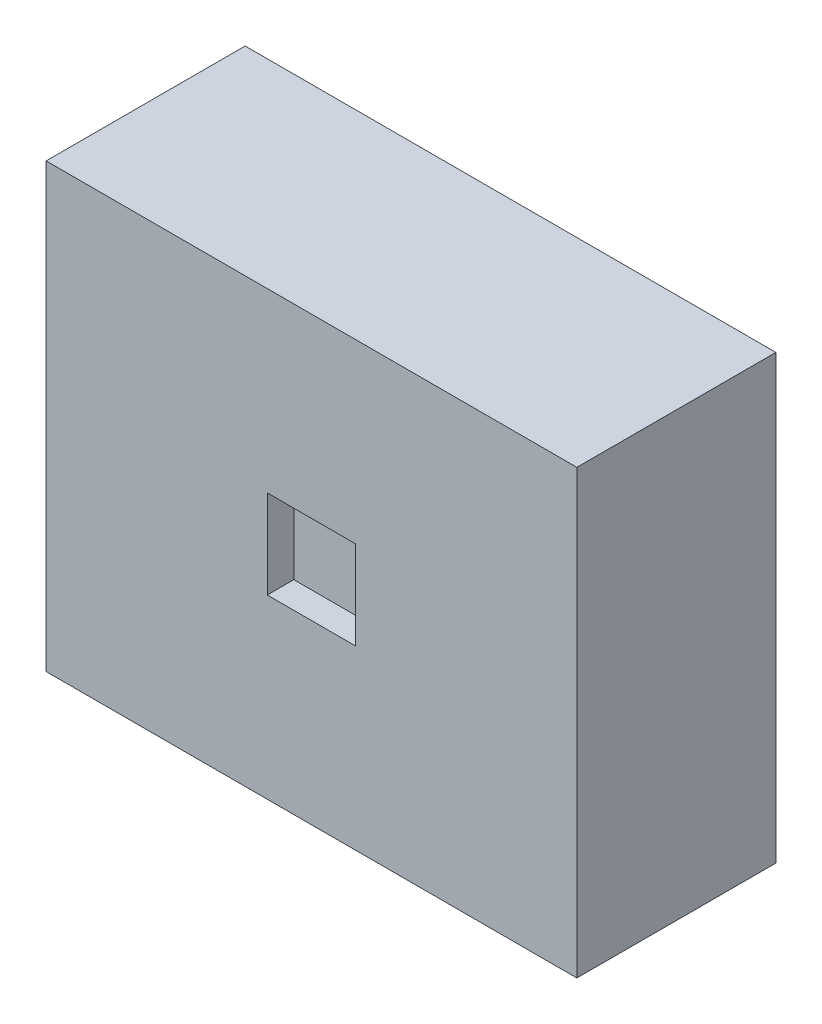
ISO-10303-21;
HEADER;
FILE_DESCRIPTION(('STEP AP214'),'2;1');
FILE_NAME('part.step','',(''),(''),'','','');
FILE_SCHEMA(('AUTOMOTIVE_DESIGN { 1 0 10303 214 1 1 1 1 }'));
ENDSEC;
DATA;
#1=APPLICATION_CONTEXT('core data for automotive mechanical design processes');
#2=APPLICATION_PROTOCOL_DEFINITION('international standard','automotive_design',2000,#1);
#3=PRODUCT_CONTEXT('',#1,'mechanical');
#4=PRODUCT('Part','Part','',(#3));
#5=PRODUCT_RELATED_PRODUCT_CATEGORY('part','',(#4));
#6=PRODUCT_DEFINITION_FORMATION('','',#4);
#7=PRODUCT_DEFINITION_CONTEXT('part definition',#1,'design');
#8=PRODUCT_DEFINITION('design','',#6,#7);
#9=PRODUCT_DEFINITION_SHAPE('','',#8);
#10=(LENGTH_UNIT() NAMED_UNIT(*) SI_UNIT(.MILLI.,.METRE.));
#11=(NAMED_UNIT(*) PLANE_ANGLE_UNIT() SI_UNIT($,.RADIAN.));
#12=(NAMED_UNIT(*) SI_UNIT($,.STERADIAN.) SOLID_ANGLE_UNIT());
#13=UNCERTAINTY_MEASURE_WITH_UNIT(LENGTH_MEASURE(1.E-05),#10,'distance_accuracy_value','');
#14=(GEOMETRIC_REPRESENTATION_CONTEXT(3) GLOBAL_UNCERTAINTY_ASSIGNED_CONTEXT((#13)) GLOBAL_UNIT_ASSIGNED_CONTEXT((#10,
#11,#12)) REPRESENTATION_CONTEXT('',''));
#15=CARTESIAN_POINT('',(0.,0.,0.));
#16=DIRECTION('',(0.,0.,1.));
#17=DIRECTION('',(1.,0.,0.));
#18=AXIS2_PLACEMENT_3D('',#15,#16,#17);
#19=CARTESIAN_POINT('',(60.,100.,22.5));
#20=DIRECTION('',(-1.,0.,0.));
#21=DIRECTION('',(0.,0.,1.));
#22=AXIS2_PLACEMENT_3D('',#19,#20,#21);
#23=PLANE('',#22);
#24=DIRECTION('',(0.,0.,-1.));
#25=VECTOR('',#24,1.);
#26=CARTESIAN_POINT('',(60.,0.,22.5));
#27=LINE('',#26,#25);
#28=CARTESIAN_POINT('',(60.,0.,22.5));
#29=VERTEX_POINT('',#28);
#30=CARTESIAN_POINT('',(60.,0.,-22.5));
#31=VERTEX_POINT('',#30);
#32=EDGE_CURVE('E140',#29,#31,#27,.T.);
#33=ORIENTED_EDGE('',*,*,#32,.T.);
#34=DIRECTION('',(0.,-1.,0.));
#35=VECTOR('',#34,1.);
#36=CARTESIAN_POINT('',(60.,100.,-22.5));
#37=LINE('',#36,#35);
#38=CARTESIAN_POINT('',(60.,100.,-22.5));
#39=VERTEX_POINT('',#38);
#40=EDGE_CURVE('E11',#39,#31,#37,.T.);
#41=ORIENTED_EDGE('',*,*,#40,.F.);
#42=DIRECTION('',(0.,0.,-1.));
#43=VECTOR('',#42,1.);
#44=CARTESIAN_POINT('',(60.,100.,22.5));
#45=LINE('',#44,#43);
#46=CARTESIAN_POINT('',(60.,100.,22.5));
#47=VERTEX_POINT('',#46);
#48=EDGE_CURVE('E144',#47,#39,#45,.T.);
#49=ORIENTED_EDGE('',*,*,#48,.F.);
#50=DIRECTION('',(0.,-1.,0.));
#51=VECTOR('',#50,1.);
#52=CARTESIAN_POINT('',(60.,100.,22.5));
#53=LINE('',#52,#51);
#54=EDGE_CURVE('E150',#47,#29,#53,.T.);
#55=ORIENTED_EDGE('',*,*,#54,.T.);
#56=EDGE_LOOP('',(#33,#41,#49,#55));
#57=FACE_BOUND('',#56,.T.);
#58=ADVANCED_FACE('F32',(#57),#23,.F.);
#59=CARTESIAN_POINT('',(-60.,100.,-22.5));
#60=DIRECTION('',(0.,0.,1.));
#61=DIRECTION('',(1.,0.,0.));
#62=AXIS2_PLACEMENT_3D('',#59,#60,#61);
#63=PLANE('',#62);
#64=DIRECTION('',(-1.,0.,0.));
#65=VECTOR('',#64,1.);
#66=CARTESIAN_POINT('',(-60.,0.,-22.5));
#67=LINE('',#66,#65);
#68=CARTESIAN_POINT('',(-60.,0.,-22.5));
#69=VERTEX_POINT('',#68);
#70=EDGE_CURVE('E153',#31,#69,#67,.T.);
#71=ORIENTED_EDGE('',*,*,#70,.T.);
#72=DIRECTION('',(0.,-1.,0.));
#73=VECTOR('',#72,1.);
#74=CARTESIAN_POINT('',(-60.,100.,-22.5));
#75=LINE('',#74,#73);
#76=CARTESIAN_POINT('',(-60.,100.,-22.5));
#77=VERTEX_POINT('',#76);
#78=EDGE_CURVE('E39',#77,#69,#75,.T.);
#79=ORIENTED_EDGE('',*,*,#78,.F.);
#80=DIRECTION('',(-1.,0.,0.));
#81=VECTOR('',#80,1.);
#82=CARTESIAN_POINT('',(-60.,100.,-22.5));
#83=LINE('',#82,#81);
#84=EDGE_CURVE('E83',#39,#77,#83,.T.);
#85=ORIENTED_EDGE('',*,*,#84,.F.);
#86=ORIENTED_EDGE('',*,*,#40,.T.);
#87=EDGE_LOOP('',(#71,#79,#85,#86));
#88=FACE_BOUND('',#87,.T.);
#89=ADVANCED_FACE('F182',(#88),#63,.F.);
#90=CARTESIAN_POINT('',(-60.,100.,22.5));
#91=DIRECTION('',(1.,0.,0.));
#92=DIRECTION('',(0.,0.,-1.));
#93=AXIS2_PLACEMENT_3D('',#90,#91,#92);
#94=PLANE('',#93);
#95=DIRECTION('',(0.,0.,1.));
#96=VECTOR('',#95,1.);
#97=CARTESIAN_POINT('',(-60.,0.,22.5));
#98=LINE('',#97,#96);
#99=CARTESIAN_POINT('',(-60.,0.,22.5));
#100=VERTEX_POINT('',#99);
#101=EDGE_CURVE('E155',#69,#100,#98,.T.);
#102=ORIENTED_EDGE('',*,*,#101,.T.);
#103=DIRECTION('',(0.,-1.,0.));
#104=VECTOR('',#103,1.);
#105=CARTESIAN_POINT('',(-60.,100.,22.5));
#106=LINE('',#105,#104);
#107=CARTESIAN_POINT('',(-60.,100.,22.5));
#108=VERTEX_POINT('',#107);
#109=EDGE_CURVE('E159',#108,#100,#106,.T.);
#110=ORIENTED_EDGE('',*,*,#109,.F.);
#111=DIRECTION('',(0.,0.,1.));
#112=VECTOR('',#111,1.);
#113=CARTESIAN_POINT('',(-60.,100.,22.5));
#114=LINE('',#113,#112);
#115=EDGE_CURVE('E147',#77,#108,#114,.T.);
#116=ORIENTED_EDGE('',*,*,#115,.F.);
#117=ORIENTED_EDGE('',*,*,#78,.T.);
#118=EDGE_LOOP('',(#102,#110,#116,#117));
#119=FACE_BOUND('',#118,.T.);
#120=ADVANCED_FACE('F164',(#119),#94,.F.);
#121=CARTESIAN_POINT('',(-60.,100.,22.5));
#122=DIRECTION('',(0.,0.,-1.));
#123=DIRECTION('',(-1.,0.,0.));
#124=AXIS2_PLACEMENT_3D('',#121,#122,#123);
#125=PLANE('',#124);
#126=DIRECTION('',(-1.,0.,0.));
#127=VECTOR('',#126,1.);
#128=CARTESIAN_POINT('',(-9.99999999999999,60.,22.5));
#129=LINE('',#128,#127);
#130=CARTESIAN_POINT('',(10.,60.,22.5));
#131=VERTEX_POINT('',#130);
#132=CARTESIAN_POINT('',(-9.99999999999999,60.,22.5));
#133=VERTEX_POINT('',#132);
#134=EDGE_CURVE('E134',#131,#133,#129,.T.);
#135=ORIENTED_EDGE('',*,*,#134,.F.);
#136=DIRECTION('',(0.,1.,0.));
#137=VECTOR('',#136,1.);
#138=CARTESIAN_POINT('',(10.,40.,22.5));
#139=LINE('',#138,#137);
#140=CARTESIAN_POINT('',(10.,40.,22.5));
#141=VERTEX_POINT('',#140);
#142=EDGE_CURVE('E46',#141,#131,#139,.T.);
#143=ORIENTED_EDGE('',*,*,#142,.F.);
#144=DIRECTION('',(1.,0.,0.));
#145=VECTOR('',#144,1.);
#146=CARTESIAN_POINT('',(-9.99999999999999,40.,22.5));
#147=LINE('',#146,#145);
#148=CARTESIAN_POINT('',(-9.99999999999999,40.,22.5));
#149=VERTEX_POINT('',#148);
#150=EDGE_CURVE('E125',#149,#141,#147,.T.);
#151=ORIENTED_EDGE('',*,*,#150,.F.);
#152=DIRECTION('',(0.,-1.,0.));
#153=VECTOR('',#152,1.);
#154=CARTESIAN_POINT('',(-9.99999999999999,40.,22.5));
#155=LINE('',#154,#153);
#156=EDGE_CURVE('E128',#133,#149,#155,.T.);
#157=ORIENTED_EDGE('',*,*,#156,.F.);
#158=EDGE_LOOP('',(#135,#143,#151,#157));
#159=FACE_BOUND('',#158,.T.);
#160=DIRECTION('',(1.,0.,0.));
#161=VECTOR('',#160,1.);
#162=CARTESIAN_POINT('',(-60.,0.,22.5));
#163=LINE('',#162,#161);
#164=EDGE_CURVE('E76',#100,#29,#163,.T.);
#165=ORIENTED_EDGE('',*,*,#164,.T.);
#166=ORIENTED_EDGE('',*,*,#54,.F.);
#167=DIRECTION('',(1.,0.,0.));
#168=VECTOR('',#167,1.);
#169=CARTESIAN_POINT('',(-60.,100.,22.5));
#170=LINE('',#169,#168);
#171=EDGE_CURVE('E55',#108,#47,#170,.T.);
#172=ORIENTED_EDGE('',*,*,#171,.F.);
#173=ORIENTED_EDGE('',*,*,#109,.T.);
#174=EDGE_LOOP('',(#165,#166,#172,#173));
#175=FACE_BOUND('',#174,.T.);
#176=ADVANCED_FACE('F172',(#159,#175),#125,.F.);
#177=CARTESIAN_POINT('',(0.,100.,0.));
#178=DIRECTION('',(0.,-1.,0.));
#179=DIRECTION('',(0.,0.,-1.));
#180=AXIS2_PLACEMENT_3D('',#177,#178,#179);
#181=PLANE('',#180);
#182=ORIENTED_EDGE('',*,*,#48,.T.);
#183=ORIENTED_EDGE('',*,*,#84,.T.);
#184=ORIENTED_EDGE('',*,*,#115,.T.);
#185=ORIENTED_EDGE('',*,*,#171,.T.);
#186=EDGE_LOOP('',(#182,#183,#184,#185));
#187=FACE_BOUND('',#186,.T.);
#188=ADVANCED_FACE('F174',(#187),#181,.F.);
#189=CARTESIAN_POINT('',(0.,0.,0.));
#190=DIRECTION('',(0.,-1.,0.));
#191=DIRECTION('',(0.,0.,-1.));
#192=AXIS2_PLACEMENT_3D('',#189,#190,#191);
#193=PLANE('',#192);
#194=ORIENTED_EDGE('',*,*,#32,.F.);
#195=ORIENTED_EDGE('',*,*,#164,.F.);
#196=ORIENTED_EDGE('',*,*,#101,.F.);
#197=ORIENTED_EDGE('',*,*,#70,.F.);
#198=EDGE_LOOP('',(#194,#195,#196,#197));
#199=FACE_BOUND('',#198,.T.);
#200=ADVANCED_FACE('F168',(#199),#193,.T.);
#201=CARTESIAN_POINT('',(10.,40.,16.5));
#202=DIRECTION('',(1.,0.,0.));
#203=DIRECTION('',(0.,0.,-1.));
#204=AXIS2_PLACEMENT_3D('',#201,#202,#203);
#205=PLANE('',#204);
#206=ORIENTED_EDGE('',*,*,#142,.T.);
#207=DIRECTION('',(0.,0.,1.));
#208=VECTOR('',#207,1.);
#209=CARTESIAN_POINT('',(10.,60.,16.5));
#210=LINE('',#209,#208);
#211=CARTESIAN_POINT('',(10.,60.,16.5));
#212=VERTEX_POINT('',#211);
#213=EDGE_CURVE('E103',#212,#131,#210,.T.);
#214=ORIENTED_EDGE('',*,*,#213,.F.);
#215=DIRECTION('',(0.,1.,0.));
#216=VECTOR('',#215,1.);
#217=CARTESIAN_POINT('',(10.,40.,16.5));
#218=LINE('',#217,#216);
#219=CARTESIAN_POINT('',(10.,40.,16.5));
#220=VERTEX_POINT('',#219);
#221=EDGE_CURVE('E107',#220,#212,#218,.T.);
#222=ORIENTED_EDGE('',*,*,#221,.F.);
#223=DIRECTION('',(0.,0.,1.));
#224=VECTOR('',#223,1.);
#225=CARTESIAN_POINT('',(10.,40.,16.5));
#226=LINE('',#225,#224);
#227=EDGE_CURVE('E138',#220,#141,#226,.T.);
#228=ORIENTED_EDGE('',*,*,#227,.T.);
#229=EDGE_LOOP('',(#206,#214,#222,#228));
#230=FACE_BOUND('',#229,.T.);
#231=ADVANCED_FACE('F105',(#230),#205,.F.);
#232=CARTESIAN_POINT('',(-9.99999999999999,40.,16.5));
#233=DIRECTION('',(0.,-1.,0.));
#234=DIRECTION('',(0.,0.,-1.));
#235=AXIS2_PLACEMENT_3D('',#232,#233,#234);
#236=PLANE('',#235);
#237=ORIENTED_EDGE('',*,*,#150,.T.);
#238=ORIENTED_EDGE('',*,*,#227,.F.);
#239=DIRECTION('',(1.,0.,0.));
#240=VECTOR('',#239,1.);
#241=CARTESIAN_POINT('',(-9.99999999999999,40.,16.5));
#242=LINE('',#241,#240);
#243=CARTESIAN_POINT('',(-9.99999999999999,40.,16.5));
#244=VERTEX_POINT('',#243);
#245=EDGE_CURVE('E113',#244,#220,#242,.T.);
#246=ORIENTED_EDGE('',*,*,#245,.F.);
#247=DIRECTION('',(0.,0.,1.));
#248=VECTOR('',#247,1.);
#249=CARTESIAN_POINT('',(-9.99999999999999,40.,16.5));
#250=LINE('',#249,#248);
#251=EDGE_CURVE('E141',#244,#149,#250,.T.);
#252=ORIENTED_EDGE('',*,*,#251,.T.);
#253=EDGE_LOOP('',(#237,#238,#246,#252));
#254=FACE_BOUND('',#253,.T.);
#255=ADVANCED_FACE('F221',(#254),#236,.F.);
#256=CARTESIAN_POINT('',(-9.99999999999999,40.,16.5));
#257=DIRECTION('',(-1.,0.,0.));
#258=DIRECTION('',(0.,0.,1.));
#259=AXIS2_PLACEMENT_3D('',#256,#257,#258);
#260=PLANE('',#259);
#261=ORIENTED_EDGE('',*,*,#156,.T.);
#262=ORIENTED_EDGE('',*,*,#251,.F.);
#263=DIRECTION('',(0.,-1.,0.));
#264=VECTOR('',#263,1.);
#265=CARTESIAN_POINT('',(-9.99999999999999,40.,16.5));
#266=LINE('',#265,#264);
#267=CARTESIAN_POINT('',(-9.99999999999999,60.,16.5));
#268=VERTEX_POINT('',#267);
#269=EDGE_CURVE('E121',#268,#244,#266,.T.);
#270=ORIENTED_EDGE('',*,*,#269,.F.);
#271=DIRECTION('',(0.,0.,1.));
#272=VECTOR('',#271,1.);
#273=CARTESIAN_POINT('',(-9.99999999999999,60.,16.5));
#274=LINE('',#273,#272);
#275=EDGE_CURVE('E112',#268,#133,#274,.T.);
#276=ORIENTED_EDGE('',*,*,#275,.T.);
#277=EDGE_LOOP('',(#261,#262,#270,#276));
#278=FACE_BOUND('',#277,.T.);
#279=ADVANCED_FACE('F230',(#278),#260,.F.);
#280=CARTESIAN_POINT('',(-9.99999999999999,60.,16.5));
#281=DIRECTION('',(0.,1.,0.));
#282=DIRECTION('',(0.,0.,1.));
#283=AXIS2_PLACEMENT_3D('',#280,#281,#282);
#284=PLANE('',#283);
#285=ORIENTED_EDGE('',*,*,#134,.T.);
#286=ORIENTED_EDGE('',*,*,#275,.F.);
#287=DIRECTION('',(-1.,0.,0.));
#288=VECTOR('',#287,1.);
#289=CARTESIAN_POINT('',(-9.99999999999999,60.,16.5));
#290=LINE('',#289,#288);
#291=EDGE_CURVE('E116',#212,#268,#290,.T.);
#292=ORIENTED_EDGE('',*,*,#291,.F.);
#293=ORIENTED_EDGE('',*,*,#213,.T.);
#294=EDGE_LOOP('',(#285,#286,#292,#293));
#295=FACE_BOUND('',#294,.T.);
#296=ADVANCED_FACE('F117',(#295),#284,.F.);
#297=CARTESIAN_POINT('',(0.,0.,16.5));
#298=DIRECTION('',(0.,0.,-1.));
#299=DIRECTION('',(-1.,0.,0.));
#300=AXIS2_PLACEMENT_3D('',#297,#298,#299);
#301=PLANE('',#300);
#302=ORIENTED_EDGE('',*,*,#221,.T.);
#303=ORIENTED_EDGE('',*,*,#291,.T.);
#304=ORIENTED_EDGE('',*,*,#269,.T.);
#305=ORIENTED_EDGE('',*,*,#245,.T.);
#306=EDGE_LOOP('',(#302,#303,#304,#305));
#307=FACE_BOUND('',#306,.T.);
#308=ADVANCED_FACE('F123',(#307),#301,.F.);
#309=CLOSED_SHELL('',(#58,#89,#120,#176,#188,#200,#231,#255,#279,#296,#308));
#310=MANIFOLD_SOLID_BREP('B2',#309);
#311=ADVANCED_BREP_SHAPE_REPRESENTATION('',(#18,#310),#14);
#312=SHAPE_DEFINITION_REPRESENTATION(#9,#311);
ENDSEC;
END-ISO-10303-21;
